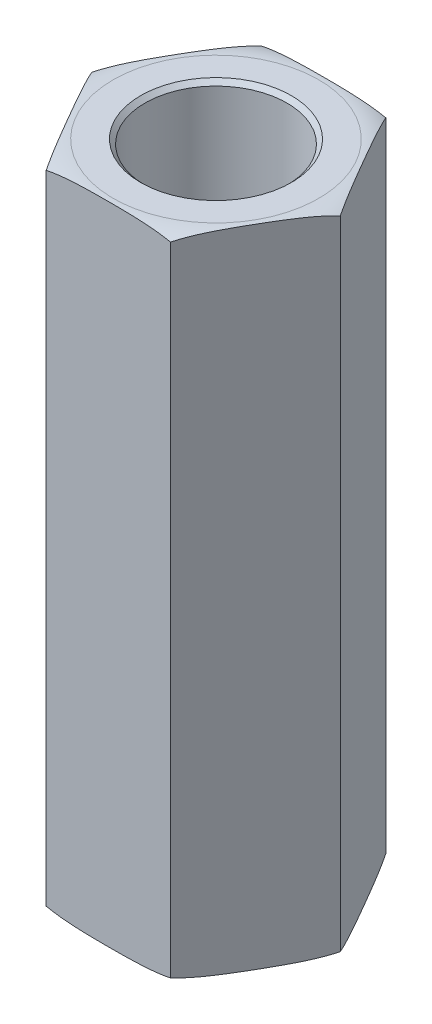
ISO-10303-21;
HEADER;
FILE_DESCRIPTION(('STEP AP214'),'2;1');
FILE_NAME('part.step','',(''),(''),'','','');
FILE_SCHEMA(('AUTOMOTIVE_DESIGN { 1 0 10303 214 1 1 1 1 }'));
ENDSEC;
DATA;
#1=APPLICATION_CONTEXT('core data for automotive mechanical design processes');
#2=APPLICATION_PROTOCOL_DEFINITION('international standard','automotive_design',2000,#1);
#3=PRODUCT_CONTEXT('',#1,'mechanical');
#4=PRODUCT('Part','Part','',(#3));
#5=PRODUCT_RELATED_PRODUCT_CATEGORY('part','',(#4));
#6=PRODUCT_DEFINITION_FORMATION('','',#4);
#7=PRODUCT_DEFINITION_CONTEXT('part definition',#1,'design');
#8=PRODUCT_DEFINITION('design','',#6,#7);
#9=PRODUCT_DEFINITION_SHAPE('','',#8);
#10=(LENGTH_UNIT() NAMED_UNIT(*) SI_UNIT(.MILLI.,.METRE.));
#11=(NAMED_UNIT(*) PLANE_ANGLE_UNIT() SI_UNIT($,.RADIAN.));
#12=(NAMED_UNIT(*) SI_UNIT($,.STERADIAN.) SOLID_ANGLE_UNIT());
#13=UNCERTAINTY_MEASURE_WITH_UNIT(LENGTH_MEASURE(1.E-05),#10,'distance_accuracy_value','');
#14=(GEOMETRIC_REPRESENTATION_CONTEXT(3) GLOBAL_UNCERTAINTY_ASSIGNED_CONTEXT((#13)) GLOBAL_UNIT_ASSIGNED_CONTEXT((#10,
#11,#12)) REPRESENTATION_CONTEXT('',''));
#15=CARTESIAN_POINT('',(0.,0.,0.));
#16=DIRECTION('',(0.,0.,1.));
#17=DIRECTION('',(1.,0.,0.));
#18=AXIS2_PLACEMENT_3D('',#15,#16,#17);
#19=CARTESIAN_POINT('',(3.66617420935412,9.525,0.));
#20=DIRECTION('',(-0.866025403784439,0.,0.5));
#21=DIRECTION('',(0.5,0.,0.866025403784439));
#22=AXIS2_PLACEMENT_3D('',#19,#20,#21);
#23=PLANE('',#22);
#24=CARTESIAN_POINT('',(3.66617420935412,9.398,0.));
#25=CARTESIAN_POINT('',(3.63753042799203,9.40993202468709,-0.0496124846400275));
#26=CARTESIAN_POINT('',(3.60875945805376,9.42055614694223,-0.0994452663561576));
#27=CARTESIAN_POINT('',(3.5510445941875,9.43952869380446,-0.199410342924434));
#28=CARTESIAN_POINT('',(3.52210079717004,9.44787829008084,-0.249542469922636));
#29=CARTESIAN_POINT('',(3.43520914920621,9.47001015084215,-0.400043218949384));
#30=CARTESIAN_POINT('',(3.37708055050429,9.48092253839952,-0.500724905273881));
#31=CARTESIAN_POINT('',(3.26070078255249,9.4975474670846,-0.702300576339476));
#32=CARTESIAN_POINT('',(3.20244972255356,9.50326351393611,-0.803194371852361));
#33=CARTESIAN_POINT('',(3.08586365366197,9.51154325238667,-1.00512736662733));
#34=CARTESIAN_POINT('',(3.02752861562773,9.5141051045623,-1.1061666163641));
#35=CARTESIAN_POINT('',(2.91138213832281,9.5174800878033,-1.30733821617637));
#36=CARTESIAN_POINT('',(2.85357078573453,9.51830898530758,-1.40747041611355));
#37=CARTESIAN_POINT('',(2.73795502274299,9.51890235146376,-1.60772279177072));
#38=CARTESIAN_POINT('',(2.68015061252642,9.51866697200316,-1.70784296716739));
#39=CARTESIAN_POINT('',(2.56452713843041,9.51693398748164,-1.9081086988493));
#40=CARTESIAN_POINT('',(2.50670807591217,9.51543597123025,-2.00825425277689));
#41=CARTESIAN_POINT('',(2.39109525560102,9.51017531674577,-2.20850153156214));
#42=CARTESIAN_POINT('',(2.33330149587798,9.50641290136093,-2.30860325976287));
#43=CARTESIAN_POINT('',(2.23849359853911,9.49698899303816,-2.47281535491256));
#44=CARTESIAN_POINT('',(2.20145192539195,9.49249057663768,-2.5369734148008));
#45=CARTESIAN_POINT('',(2.12747060706785,9.48130148199487,-2.66511281694908));
#46=CARTESIAN_POINT('',(2.09053091530161,9.47461207209161,-2.72909423990413));
#47=CARTESIAN_POINT('',(2.01669860633929,9.45839780386584,-2.85697555026699));
#48=CARTESIAN_POINT('',(1.97980639337021,9.44886525006224,-2.92087473753309));
#49=CARTESIAN_POINT('',(1.90623831426152,9.42626291445617,-3.04829838836459));
#50=CARTESIAN_POINT('',(1.86956287153406,9.41318767878213,-3.11182211855863));
#51=CARTESIAN_POINT('',(1.83308710467706,9.398,-3.175));
#52=B_SPLINE_CURVE_WITH_KNOTS('',3,(#24,#25,#26,#27,#28,#29,#30,#31,#32,#33,#34,#35,#36,#37,#38,
#39,#40,#41,#42,#43,#44,#45,#46,#47,#48,#49,#50,#51),.UNSPECIFIED.,.F.,.F.,(4,2,2,2,2,2,2,2,2,2,
2,2,2,4),(0.,0.17550946738822,0.350928353443244,0.701031261588482,1.05089779629354,
1.40096826525493,1.74783967758031,2.09466158796881,2.44159648808703,2.78849725058543,
3.0111319819994,3.23363806003511,3.45675194236245,3.68021127402553),.UNSPECIFIED.);
#53=CARTESIAN_POINT('',(3.66617420935412,9.398,0.));
#54=VERTEX_POINT('',#53);
#55=CARTESIAN_POINT('',(1.83308710467706,9.398,-3.175));
#56=VERTEX_POINT('',#55);
#57=EDGE_CURVE('E108',#54,#56,#52,.T.);
#58=ORIENTED_EDGE('',*,*,#57,.F.);
#59=DIRECTION('',(0.,1.,0.));
#60=VECTOR('',#59,1.);
#61=CARTESIAN_POINT('',(3.66617420935412,9.525,0.));
#62=LINE('',#61,#60);
#63=CARTESIAN_POINT('',(3.66617420935412,-9.398,0.));
#64=VERTEX_POINT('',#63);
#65=EDGE_CURVE('E81',#54,#64,#62,.F.);
#66=ORIENTED_EDGE('',*,*,#65,.T.);
#67=CARTESIAN_POINT('',(1.83308710467705,-9.398,-3.17500000000001));
#68=CARTESIAN_POINT('',(1.86173088603914,-9.40993202468709,-3.12538751535998));
#69=CARTESIAN_POINT('',(1.89050185597741,-9.42055614694223,-3.07555473364385));
#70=CARTESIAN_POINT('',(1.94821671984367,-9.43952869380445,-2.97558965707558));
#71=CARTESIAN_POINT('',(1.97716051686113,-9.44787829008084,-2.92545753007738));
#72=CARTESIAN_POINT('',(2.06405216482496,-9.47001015084215,-2.77495678105063));
#73=CARTESIAN_POINT('',(2.12218076352687,-9.48092253839952,-2.67427509472614));
#74=CARTESIAN_POINT('',(2.23856053147867,-9.4975474670846,-2.47269942366054));
#75=CARTESIAN_POINT('',(2.2968115914776,-9.50326351393611,-2.37180562814766));
#76=CARTESIAN_POINT('',(2.41339766036919,-9.51154325238667,-2.1698726333727));
#77=CARTESIAN_POINT('',(2.47173269840343,-9.5141051045623,-2.06883338363593));
#78=CARTESIAN_POINT('',(2.58787917570835,-9.5174800878033,-1.86766178382366));
#79=CARTESIAN_POINT('',(2.64569052829663,-9.51830898530758,-1.76752958388648));
#80=CARTESIAN_POINT('',(2.76130629128816,-9.51890235146376,-1.56727720822931));
#81=CARTESIAN_POINT('',(2.81911070150473,-9.51866697200316,-1.46715703283265));
#82=CARTESIAN_POINT('',(2.93473417560074,-9.51693398748165,-1.26689130115074));
#83=CARTESIAN_POINT('',(2.99255323811898,-9.51543597123026,-1.16674574722316));
#84=CARTESIAN_POINT('',(3.10816605843013,-9.51017531674577,-0.966498468437907));
#85=CARTESIAN_POINT('',(3.16595981815317,-9.50641290136093,-0.866396740237176));
#86=CARTESIAN_POINT('',(3.26076771549203,-9.49698899303816,-0.702184645087488));
#87=CARTESIAN_POINT('',(3.2978093886392,-9.49249057663768,-0.63802658519924));
#88=CARTESIAN_POINT('',(3.37179070696331,-9.48130148199488,-0.509887183050958));
#89=CARTESIAN_POINT('',(3.40873039872954,-9.47461207209161,-0.445905760095904));
#90=CARTESIAN_POINT('',(3.48256270769187,-9.45839780386584,-0.318024449733033));
#91=CARTESIAN_POINT('',(3.51945492066095,-9.44886525006225,-0.254125262466928));
#92=CARTESIAN_POINT('',(3.59302299976965,-9.42626291445618,-0.126701611635421));
#93=CARTESIAN_POINT('',(3.62969844249711,-9.41318767878214,-0.0631778814413773));
#94=CARTESIAN_POINT('',(3.66617420935412,-9.398,0.));
#95=B_SPLINE_CURVE_WITH_KNOTS('',3,(#67,#68,#69,#70,#71,#72,#73,#74,#75,#76,#77,#78,#79,#80,#81,
#82,#83,#84,#85,#86,#87,#88,#89,#90,#91,#92,#93,#94),.UNSPECIFIED.,.F.,.F.,(4,2,2,2,2,2,2,2,2,2,
2,2,2,4),(0.,0.175509467388216,0.350928353443236,0.701031261588468,1.05089779629352,
1.4009682652549,1.74783967758028,2.09466158796877,2.44159648808698,2.78849725058538,
3.01113198199936,3.23363806003509,3.45675194236244,3.68021127402553),.UNSPECIFIED.);
#96=CARTESIAN_POINT('',(1.83308710467705,-9.398,-3.175));
#97=VERTEX_POINT('',#96);
#98=EDGE_CURVE('E98',#97,#64,#95,.T.);
#99=ORIENTED_EDGE('',*,*,#98,.F.);
#100=DIRECTION('',(0.,1.,0.));
#101=VECTOR('',#100,1.);
#102=CARTESIAN_POINT('',(1.83308710467705,9.525,-3.175));
#103=LINE('',#102,#101);
#104=EDGE_CURVE('E112',#97,#56,#103,.T.);
#105=ORIENTED_EDGE('',*,*,#104,.T.);
#106=EDGE_LOOP('',(#58,#66,#99,#105));
#107=FACE_BOUND('',#106,.T.);
#108=ADVANCED_FACE('F17',(#107),#23,.F.);
#109=CARTESIAN_POINT('',(1.83308710467706,9.525,3.17499999999999));
#110=DIRECTION('',(-0.866025403784439,0.,-0.5));
#111=DIRECTION('',(-0.5,0.,0.866025403784439));
#112=AXIS2_PLACEMENT_3D('',#109,#110,#111);
#113=PLANE('',#112);
#114=CARTESIAN_POINT('',(1.83308710467706,9.398,3.17499999999999));
#115=CARTESIAN_POINT('',(1.86173088603915,9.40993202468709,3.12538751535996));
#116=CARTESIAN_POINT('',(1.89050185597743,9.42055614694223,3.07555473364383));
#117=CARTESIAN_POINT('',(1.94821671984368,9.43952869380446,2.97558965707556));
#118=CARTESIAN_POINT('',(1.97716051686114,9.44787829008084,2.92545753007735));
#119=CARTESIAN_POINT('',(2.06405216482498,9.47001015084215,2.77495678105061));
#120=CARTESIAN_POINT('',(2.12218076352689,9.48092253839952,2.67427509472611));
#121=CARTESIAN_POINT('',(2.23856053147869,9.4975474670846,2.47269942366051));
#122=CARTESIAN_POINT('',(2.29681159147762,9.50326351393611,2.37180562814763));
#123=CARTESIAN_POINT('',(2.41339766036921,9.51154325238667,2.16987263337266));
#124=CARTESIAN_POINT('',(2.47173269840345,9.5141051045623,2.06883338363589));
#125=CARTESIAN_POINT('',(2.58787917570837,9.5174800878033,1.86766178382362));
#126=CARTESIAN_POINT('',(2.64569052829666,9.51830898530758,1.76752958388644));
#127=CARTESIAN_POINT('',(2.76130629128819,9.51890235146376,1.56727720822927));
#128=CARTESIAN_POINT('',(2.81911070150476,9.51866697200316,1.4671570328326));
#129=CARTESIAN_POINT('',(2.93473417560078,9.51693398748164,1.26689130115069));
#130=CARTESIAN_POINT('',(2.99255323811901,9.51543597123025,1.1667457472231));
#131=CARTESIAN_POINT('',(3.10816605843017,9.51017531674577,0.966498468437848));
#132=CARTESIAN_POINT('',(3.16595981815321,9.50641290136093,0.866396740237115));
#133=CARTESIAN_POINT('',(3.26076771549207,9.49698899303816,0.702184645087431));
#134=CARTESIAN_POINT('',(3.29780938863923,9.49249057663768,0.638026585199189));
#135=CARTESIAN_POINT('',(3.37179070696333,9.48130148199487,0.509887183050919));
#136=CARTESIAN_POINT('',(3.40873039872956,9.47461207209161,0.44590576009587));
#137=CARTESIAN_POINT('',(3.48256270769188,9.45839780386584,0.31802444973301));
#138=CARTESIAN_POINT('',(3.51945492066096,9.44886525006224,0.254125262466912));
#139=CARTESIAN_POINT('',(3.59302299976965,9.42626291445617,0.126701611635416));
#140=CARTESIAN_POINT('',(3.62969844249711,9.41318767878213,0.0631778814413771));
#141=CARTESIAN_POINT('',(3.66617420935412,9.398,0.));
#142=B_SPLINE_CURVE_WITH_KNOTS('',3,(#114,#115,#116,#117,#118,#119,#120,#121,#122,#123,#124,
#125,#126,#127,#128,#129,#130,#131,#132,#133,#134,#135,#136,#137,#138,#139,#140,#141),
.UNSPECIFIED.,.F.,.F.,(4,2,2,2,2,2,2,2,2,2,2,2,2,4),(0.,0.17550946738822,0.350928353443244,
0.701031261588483,1.05089779629354,1.40096826525493,1.74783967758031,2.09466158796881,
2.44159648808703,2.78849725058544,3.01113198199939,3.2336380600351,3.45675194236244,
3.68021127402551),.UNSPECIFIED.);
#143=CARTESIAN_POINT('',(1.83308710467707,9.398,3.17499999999999));
#144=VERTEX_POINT('',#143);
#145=EDGE_CURVE('E22',#144,#54,#142,.T.);
#146=ORIENTED_EDGE('',*,*,#145,.F.);
#147=DIRECTION('',(0.,1.,0.));
#148=VECTOR('',#147,1.);
#149=CARTESIAN_POINT('',(1.83308710467707,9.525,3.17499999999999));
#150=LINE('',#149,#148);
#151=CARTESIAN_POINT('',(1.83308710467706,-9.398,3.17499999999999));
#152=VERTEX_POINT('',#151);
#153=EDGE_CURVE('E101',#144,#152,#150,.F.);
#154=ORIENTED_EDGE('',*,*,#153,.T.);
#155=CARTESIAN_POINT('',(3.66617420935412,-9.398,0.));
#156=CARTESIAN_POINT('',(3.63753042799203,-9.40993202468709,0.0496124846400324));
#157=CARTESIAN_POINT('',(3.60875945805375,-9.42055614694223,0.0994452663561624));
#158=CARTESIAN_POINT('',(3.5510445941875,-9.43952869380445,0.199410342924438));
#159=CARTESIAN_POINT('',(3.52210079717004,-9.44787829008084,0.24954246992264));
#160=CARTESIAN_POINT('',(3.43520914920621,-9.47001015084215,0.400043218949389));
#161=CARTESIAN_POINT('',(3.37708055050429,-9.48092253839952,0.500724905273886));
#162=CARTESIAN_POINT('',(3.26070078255249,-9.4975474670846,0.702300576339482));
#163=CARTESIAN_POINT('',(3.20244972255356,-9.50326351393611,0.803194371852367));
#164=CARTESIAN_POINT('',(3.08586365366197,-9.51154325238667,1.00512736662734));
#165=CARTESIAN_POINT('',(3.02752861562773,-9.5141051045623,1.1061666163641));
#166=CARTESIAN_POINT('',(2.91138213832281,-9.5174800878033,1.30733821617637));
#167=CARTESIAN_POINT('',(2.85357078573452,-9.51830898530758,1.40747041611356));
#168=CARTESIAN_POINT('',(2.73795502274299,-9.51890235146376,1.60772279177073));
#169=CARTESIAN_POINT('',(2.68015061252642,-9.51866697200316,1.70784296716739));
#170=CARTESIAN_POINT('',(2.5645271384304,-9.51693398748164,1.90810869884931));
#171=CARTESIAN_POINT('',(2.50670807591217,-9.51543597123025,2.00825425277689));
#172=CARTESIAN_POINT('',(2.39109525560101,-9.51017531674577,2.20850153156215));
#173=CARTESIAN_POINT('',(2.33330149587797,-9.50641290136093,2.30860325976288));
#174=CARTESIAN_POINT('',(2.23849359853911,-9.49698899303816,2.47281535491257));
#175=CARTESIAN_POINT('',(2.20145192539195,-9.49249057663768,2.53697341480081));
#176=CARTESIAN_POINT('',(2.12747060706785,-9.48130148199487,2.66511281694908));
#177=CARTESIAN_POINT('',(2.09053091530162,-9.47461207209161,2.72909423990413));
#178=CARTESIAN_POINT('',(2.0166986063393,-9.45839780386584,2.85697555026699));
#179=CARTESIAN_POINT('',(1.97980639337022,-9.44886525006225,2.92087473753308));
#180=CARTESIAN_POINT('',(1.90623831426153,-9.42626291445618,3.04829838836458));
#181=CARTESIAN_POINT('',(1.86956287153407,-9.41318767878214,3.11182211855862));
#182=CARTESIAN_POINT('',(1.83308710467706,-9.398,3.17499999999999));
#183=B_SPLINE_CURVE_WITH_KNOTS('',3,(#155,#156,#157,#158,#159,#160,#161,#162,#163,#164,#165,
#166,#167,#168,#169,#170,#171,#172,#173,#174,#175,#176,#177,#178,#179,#180,#181,#182),
.UNSPECIFIED.,.F.,.F.,(4,2,2,2,2,2,2,2,2,2,2,2,2,4),(0.,0.175509467388219,0.350928353443244,
0.701031261588483,1.05089779629354,1.40096826525493,1.74783967758031,2.09466158796881,
2.44159648808703,2.78849725058544,3.01113198199939,3.2336380600351,3.45675194236244,
3.68021127402551),.UNSPECIFIED.);
#184=EDGE_CURVE('E215',#64,#152,#183,.T.);
#185=ORIENTED_EDGE('',*,*,#184,.F.);
#186=ORIENTED_EDGE('',*,*,#65,.F.);
#187=EDGE_LOOP('',(#146,#154,#185,#186));
#188=FACE_BOUND('',#187,.T.);
#189=ADVANCED_FACE('F107',(#188),#113,.F.);
#190=CARTESIAN_POINT('',(-1.83308710467707,9.525,3.175));
#191=DIRECTION('',(0.,0.,-1.));
#192=DIRECTION('',(-1.,0.,0.));
#193=AXIS2_PLACEMENT_3D('',#190,#191,#192);
#194=PLANE('',#193);
#195=ORIENTED_EDGE('',*,*,#153,.F.);
#196=CARTESIAN_POINT('',(-1.83308710467707,9.39799999999999,3.175));
#197=CARTESIAN_POINT('',(-1.75760871054776,9.41371230122365,3.175));
#198=CARTESIAN_POINT('',(-1.68170571468658,9.4271647800808,3.175));
#199=CARTESIAN_POINT('',(-1.52939807527773,9.45030486470105,3.175));
#200=CARTESIAN_POINT('',(-1.45299400110163,9.45999617502722,3.175));
#201=CARTESIAN_POINT('',(-1.30011823209763,9.47637135267139,3.175));
#202=CARTESIAN_POINT('',(-1.22364747610196,9.48306442247852,3.175));
#203=CARTESIAN_POINT('',(-1.07052459410173,9.49417241699752,3.175));
#204=CARTESIAN_POINT('',(-0.993872424115956,9.49858671655426,3.175));
#205=CARTESIAN_POINT('',(-0.840856910195845,9.50572419802799,3.175));
#206=CARTESIAN_POINT('',(-0.764493913329281,9.50845527367792,3.175));
#207=CARTESIAN_POINT('',(-0.611734616938516,9.51275632258004,3.175));
#208=CARTESIAN_POINT('',(-0.535338316331409,9.51432625473884,3.175));
#209=CARTESIAN_POINT('',(-0.38245423122642,9.51668247076568,3.175));
#210=CARTESIAN_POINT('',(-0.305966435115039,9.51746792759645,3.175));
#211=CARTESIAN_POINT('',(-0.152985759387012,9.51848841069005,3.175));
#212=CARTESIAN_POINT('',(-0.076492879693506,9.51872342414921,3.175));
#213=CARTESIAN_POINT('',(0.0764928796935065,9.51872342414921,3.175));
#214=CARTESIAN_POINT('',(0.152985759387013,9.51848841069005,3.17499999999999));
#215=CARTESIAN_POINT('',(0.305966435115039,9.51746792759645,3.17499999999999));
#216=CARTESIAN_POINT('',(0.38245423122642,9.51668247076568,3.17499999999999));
#217=CARTESIAN_POINT('',(0.535338316331409,9.51432625473884,3.17499999999999));
#218=CARTESIAN_POINT('',(0.611734616938516,9.51275632258004,3.17499999999999));
#219=CARTESIAN_POINT('',(0.764493913329281,9.50845527367792,3.17499999999999));
#220=CARTESIAN_POINT('',(0.840856910195845,9.50572419802799,3.17499999999999));
#221=CARTESIAN_POINT('',(0.993872424115955,9.49858671655426,3.17499999999999));
#222=CARTESIAN_POINT('',(1.07052459410172,9.49417241699752,3.17499999999999));
#223=CARTESIAN_POINT('',(1.22364747610196,9.48306442247852,3.17499999999999));
#224=CARTESIAN_POINT('',(1.30011823209763,9.47637135267139,3.17499999999999));
#225=CARTESIAN_POINT('',(1.45299400110163,9.45999617502723,3.17499999999999));
#226=CARTESIAN_POINT('',(1.52939807527773,9.45030486470105,3.17499999999999));
#227=CARTESIAN_POINT('',(1.68170571468658,9.42716478008081,3.17499999999999));
#228=CARTESIAN_POINT('',(1.75760871054776,9.41371230122365,3.17499999999999));
#229=CARTESIAN_POINT('',(1.83308710467707,9.398,3.17499999999999));
#230=B_SPLINE_CURVE_WITH_KNOTS('',3,(#196,#197,#198,#199,#200,#201,#202,#203,#204,#205,#206,
#207,#208,#209,#210,#211,#212,#213,#214,#215,#216,#217,#218,#219,#220,#221,#222,#223,#224,#225,
#226,#227,#228,#229),.UNSPECIFIED.,.F.,.F.,(4,2,2,2,2,2,2,2,2,2,2,2,2,2,2,2,4),(0.,
0.23119079437731,0.46215329593589,0.692401964780504,0.922713766248053,1.15193709952408,
1.3811685447265,1.61064140410055,1.84011960111017,2.06959779811978,2.29907065749383,
2.52830210269626,2.75752543597228,2.98783723743982,3.21808590628444,3.44904840784302,
3.68023920222033),.UNSPECIFIED.);
#231=CARTESIAN_POINT('',(-1.83308710467707,9.398,3.175));
#232=VERTEX_POINT('',#231);
#233=EDGE_CURVE('E87',#232,#144,#230,.T.);
#234=ORIENTED_EDGE('',*,*,#233,.F.);
#235=DIRECTION('',(0.,1.,0.));
#236=VECTOR('',#235,1.);
#237=CARTESIAN_POINT('',(-1.83308710467707,9.525,3.175));
#238=LINE('',#237,#236);
#239=CARTESIAN_POINT('',(-1.83308710467707,-9.398,3.175));
#240=VERTEX_POINT('',#239);
#241=EDGE_CURVE('E105',#232,#240,#238,.F.);
#242=ORIENTED_EDGE('',*,*,#241,.T.);
#243=CARTESIAN_POINT('',(1.83308710467706,-9.398,3.17499999999999));
#244=CARTESIAN_POINT('',(1.75760871054776,-9.41371230122365,3.17499999999999));
#245=CARTESIAN_POINT('',(1.68170571468658,-9.42716478008081,3.17499999999999));
#246=CARTESIAN_POINT('',(1.52939807527773,-9.45030486470105,3.17499999999999));
#247=CARTESIAN_POINT('',(1.45299400110163,-9.45999617502723,3.17499999999999));
#248=CARTESIAN_POINT('',(1.30011823209763,-9.47637135267139,3.17499999999999));
#249=CARTESIAN_POINT('',(1.22364747610196,-9.48306442247852,3.17499999999999));
#250=CARTESIAN_POINT('',(1.07052459410172,-9.49417241699752,3.17499999999999));
#251=CARTESIAN_POINT('',(0.993872424115954,-9.49858671655426,3.17499999999999));
#252=CARTESIAN_POINT('',(0.840856910195844,-9.50572419802799,3.17499999999999));
#253=CARTESIAN_POINT('',(0.76449391332928,-9.50845527367792,3.17499999999999));
#254=CARTESIAN_POINT('',(0.611734616938514,-9.51275632258004,3.17499999999999));
#255=CARTESIAN_POINT('',(0.535338316331408,-9.51432625473884,3.17499999999999));
#256=CARTESIAN_POINT('',(0.382454231226419,-9.51668247076568,3.17499999999999));
#257=CARTESIAN_POINT('',(0.305966435115038,-9.51746792759645,3.17499999999999));
#258=CARTESIAN_POINT('',(0.152985759387012,-9.51848841069005,3.17499999999999));
#259=CARTESIAN_POINT('',(0.076492879693506,-9.51872342414921,3.175));
#260=CARTESIAN_POINT('',(-0.0764928796935062,-9.51872342414921,3.175));
#261=CARTESIAN_POINT('',(-0.152985759387012,-9.51848841069005,3.175));
#262=CARTESIAN_POINT('',(-0.305966435115038,-9.51746792759645,3.175));
#263=CARTESIAN_POINT('',(-0.382454231226419,-9.51668247076568,3.175));
#264=CARTESIAN_POINT('',(-0.535338316331408,-9.51432625473884,3.175));
#265=CARTESIAN_POINT('',(-0.611734616938515,-9.51275632258004,3.175));
#266=CARTESIAN_POINT('',(-0.76449391332928,-9.50845527367792,3.175));
#267=CARTESIAN_POINT('',(-0.840856910195844,-9.50572419802799,3.175));
#268=CARTESIAN_POINT('',(-0.993872424115954,-9.49858671655426,3.175));
#269=CARTESIAN_POINT('',(-1.07052459410172,-9.49417241699752,3.175));
#270=CARTESIAN_POINT('',(-1.22364747610196,-9.48306442247852,3.175));
#271=CARTESIAN_POINT('',(-1.30011823209763,-9.47637135267139,3.175));
#272=CARTESIAN_POINT('',(-1.45299400110163,-9.45999617502722,3.175));
#273=CARTESIAN_POINT('',(-1.52939807527773,-9.45030486470105,3.175));
#274=CARTESIAN_POINT('',(-1.68170571468658,-9.4271647800808,3.175));
#275=CARTESIAN_POINT('',(-1.75760871054776,-9.41371230122365,3.175));
#276=CARTESIAN_POINT('',(-1.83308710467706,-9.398,3.175));
#277=B_SPLINE_CURVE_WITH_KNOTS('',3,(#243,#244,#245,#246,#247,#248,#249,#250,#251,#252,#253,
#254,#255,#256,#257,#258,#259,#260,#261,#262,#263,#264,#265,#266,#267,#268,#269,#270,#271,#272,
#273,#274,#275,#276),.UNSPECIFIED.,.F.,.F.,(4,2,2,2,2,2,2,2,2,2,2,2,2,2,2,2,4),(0.,
0.23119079437731,0.462153295935889,0.692401964780503,0.922713766248051,1.15193709952407,
1.3811685447265,1.61064140410055,1.84011960111016,2.06959779811977,2.29907065749383,
2.52830210269625,2.75752543597227,2.98783723743982,3.21808590628443,3.44904840784301,
3.68023920222032),.UNSPECIFIED.);
#278=EDGE_CURVE('E103',#152,#240,#277,.T.);
#279=ORIENTED_EDGE('',*,*,#278,.F.);
#280=EDGE_LOOP('',(#195,#234,#242,#279));
#281=FACE_BOUND('',#280,.T.);
#282=ADVANCED_FACE('F102',(#281),#194,.F.);
#283=CARTESIAN_POINT('',(-3.66617420935413,9.525,0.));
#284=DIRECTION('',(0.866025403784439,0.,-0.499999999999999));
#285=DIRECTION('',(-0.499999999999999,0.,-0.866025403784439));
#286=AXIS2_PLACEMENT_3D('',#283,#284,#285);
#287=PLANE('',#286);
#288=CARTESIAN_POINT('',(-3.66617420935412,9.39799999999999,0.));
#289=CARTESIAN_POINT('',(-3.63753042799204,9.40993202468708,0.0496124846400222));
#290=CARTESIAN_POINT('',(-3.60875945805377,9.42055614694222,0.0994452663561455));
#291=CARTESIAN_POINT('',(-3.55104459418752,9.43952869380445,0.199410342924408));
#292=CARTESIAN_POINT('',(-3.52210079717006,9.44787829008083,0.249542469922603));
#293=CARTESIAN_POINT('',(-3.43520914920624,9.47001015084215,0.400043218949332));
#294=CARTESIAN_POINT('',(-3.37708055050434,9.48092253839951,0.500724905273816));
#295=CARTESIAN_POINT('',(-3.26070078255255,9.4975474670846,0.702300576339384));
#296=CARTESIAN_POINT('',(-3.20244972255363,9.50326351393611,0.803194371852256));
#297=CARTESIAN_POINT('',(-3.08586365366205,9.51154325238667,1.0051273666272));
#298=CARTESIAN_POINT('',(-3.02752861562782,9.5141051045623,1.10616661636395));
#299=CARTESIAN_POINT('',(-2.91138213832292,9.5174800878033,1.30733821617619));
#300=CARTESIAN_POINT('',(-2.85357078573464,9.51830898530758,1.40747041611336));
#301=CARTESIAN_POINT('',(-2.73795502274313,9.51890235146376,1.60772279177051));
#302=CARTESIAN_POINT('',(-2.68015061252656,9.51866697200317,1.70784296716716));
#303=CARTESIAN_POINT('',(-2.56452713843056,9.51693398748165,1.90810869884905));
#304=CARTESIAN_POINT('',(-2.50670807591233,9.51543597123026,2.00825425277662));
#305=CARTESIAN_POINT('',(-2.39109525560119,9.51017531674578,2.20850153156185));
#306=CARTESIAN_POINT('',(-2.33330149587816,9.50641290136095,2.30860325976257));
#307=CARTESIAN_POINT('',(-2.23849359853929,9.49698899303818,2.47281535491227));
#308=CARTESIAN_POINT('',(-2.20145192539211,9.4924905766377,2.53697341480054));
#309=CARTESIAN_POINT('',(-2.12747060706798,9.48130148199489,2.66511281694887));
#310=CARTESIAN_POINT('',(-2.09053091530173,9.47461207209163,2.72909423990394));
#311=CARTESIAN_POINT('',(-2.01669860633938,9.45839780386585,2.85697555026686));
#312=CARTESIAN_POINT('',(-1.97980639337028,9.44886525006226,2.92087473753298));
#313=CARTESIAN_POINT('',(-1.90623831426156,9.42626291445618,3.04829838836453));
#314=CARTESIAN_POINT('',(-1.86956287153409,9.41318767878214,3.1118221185586));
#315=CARTESIAN_POINT('',(-1.83308710467707,9.39799999999999,3.175));
#316=B_SPLINE_CURVE_WITH_KNOTS('',3,(#288,#289,#290,#291,#292,#293,#294,#295,#296,#297,#298,
#299,#300,#301,#302,#303,#304,#305,#306,#307,#308,#309,#310,#311,#312,#313,#314,#315),
.UNSPECIFIED.,.F.,.F.,(4,2,2,2,2,2,2,2,2,2,2,2,2,4),(0.,0.175509467388196,0.350928353443197,
0.70103126158839,1.0508977962934,1.40096826525474,1.74783967758008,2.09466158796853,
2.4415964880867,2.78849725058507,3.01113198199912,3.23363806003492,3.45675194236235,
3.68021127402552),.UNSPECIFIED.);
#317=CARTESIAN_POINT('',(-3.66617420935413,9.39799999999999,0.));
#318=VERTEX_POINT('',#317);
#319=EDGE_CURVE('E95',#318,#232,#316,.T.);
#320=ORIENTED_EDGE('',*,*,#319,.F.);
#321=DIRECTION('',(0.,1.,0.));
#322=VECTOR('',#321,1.);
#323=CARTESIAN_POINT('',(-3.66617420935413,9.525,0.));
#324=LINE('',#323,#322);
#325=CARTESIAN_POINT('',(-3.66617420935413,-9.398,0.));
#326=VERTEX_POINT('',#325);
#327=EDGE_CURVE('E119',#318,#326,#324,.F.);
#328=ORIENTED_EDGE('',*,*,#327,.T.);
#329=CARTESIAN_POINT('',(-1.83308710467707,-9.39799999999999,3.175));
#330=CARTESIAN_POINT('',(-1.86173088603915,-9.40993202468708,3.12538751535998));
#331=CARTESIAN_POINT('',(-1.89050185597742,-9.42055614694222,3.07555473364385));
#332=CARTESIAN_POINT('',(-1.94821671984367,-9.43952869380445,2.97558965707558));
#333=CARTESIAN_POINT('',(-1.97716051686113,-9.44787829008083,2.92545753007739));
#334=CARTESIAN_POINT('',(-2.06405216482496,-9.47001015084215,2.77495678105065));
#335=CARTESIAN_POINT('',(-2.12218076352686,-9.48092253839952,2.67427509472617));
#336=CARTESIAN_POINT('',(-2.23856053147865,-9.4975474670846,2.47269942366059));
#337=CARTESIAN_POINT('',(-2.29681159147757,-9.50326351393611,2.37180562814772));
#338=CARTESIAN_POINT('',(-2.41339766036916,-9.51154325238667,2.16987263337277));
#339=CARTESIAN_POINT('',(-2.47173269840339,-9.5141051045623,2.06883338363601));
#340=CARTESIAN_POINT('',(-2.5878791757083,-9.5174800878033,1.86766178382376));
#341=CARTESIAN_POINT('',(-2.64569052829658,-9.51830898530758,1.76752958388659));
#342=CARTESIAN_POINT('',(-2.7613062912881,-9.51890235146376,1.56727720822944));
#343=CARTESIAN_POINT('',(-2.81911070150467,-9.51866697200316,1.46715703283278));
#344=CARTESIAN_POINT('',(-2.93473417560067,-9.51693398748165,1.26689130115088));
#345=CARTESIAN_POINT('',(-2.9925532381189,-9.51543597123026,1.16674574722331));
#346=CARTESIAN_POINT('',(-3.10816605843004,-9.51017531674578,0.966498468438076));
#347=CARTESIAN_POINT('',(-3.16595981815307,-9.50641290136094,0.866396740237353));
#348=CARTESIAN_POINT('',(-3.26076771549194,-9.49698899303818,0.702184645087658));
#349=CARTESIAN_POINT('',(-3.29780938863912,-9.49249057663769,0.638026585199395));
#350=CARTESIAN_POINT('',(-3.37179070696324,-9.48130148199489,0.509887183051082));
#351=CARTESIAN_POINT('',(-3.40873039872949,-9.47461207209162,0.445905760096013));
#352=CARTESIAN_POINT('',(-3.48256270769183,-9.45839780386585,0.318024449733112));
#353=CARTESIAN_POINT('',(-3.51945492066092,-9.44886525006225,0.254125262466993));
#354=CARTESIAN_POINT('',(-3.59302299976963,-9.42626291445618,0.126701611635455));
#355=CARTESIAN_POINT('',(-3.6296984424971,-9.41318767878214,0.0631778814413959));
#356=CARTESIAN_POINT('',(-3.66617420935412,-9.398,0.));
#357=B_SPLINE_CURVE_WITH_KNOTS('',3,(#329,#330,#331,#332,#333,#334,#335,#336,#337,#338,#339,
#340,#341,#342,#343,#344,#345,#346,#347,#348,#349,#350,#351,#352,#353,#354,#355,#356),
.UNSPECIFIED.,.F.,.F.,(4,2,2,2,2,2,2,2,2,2,2,2,2,4),(0.,0.175509467388203,0.350928353443209,
0.701031261588413,1.05089779629344,1.40096826525479,1.74783967758014,2.0946615879686,
2.44159648808678,2.78849725058516,3.01113198199919,3.23363806003497,3.45675194236238,
3.68021127402552),.UNSPECIFIED.);
#358=EDGE_CURVE('E204',#240,#326,#357,.T.);
#359=ORIENTED_EDGE('',*,*,#358,.F.);
#360=ORIENTED_EDGE('',*,*,#241,.F.);
#361=EDGE_LOOP('',(#320,#328,#359,#360));
#362=FACE_BOUND('',#361,.T.);
#363=ADVANCED_FACE('F198',(#362),#287,.F.);
#364=CARTESIAN_POINT('',(-1.83308710467707,9.525,-3.175));
#365=DIRECTION('',(0.866025403784439,0.,0.5));
#366=DIRECTION('',(0.5,0.,-0.866025403784439));
#367=AXIS2_PLACEMENT_3D('',#364,#365,#366);
#368=PLANE('',#367);
#369=CARTESIAN_POINT('',(-1.83308710467706,9.39799999999999,-3.17500000000001));
#370=CARTESIAN_POINT('',(-1.86173088603915,9.40993202468708,-3.12538751535999));
#371=CARTESIAN_POINT('',(-1.89050185597742,9.42055614694222,-3.07555473364386));
#372=CARTESIAN_POINT('',(-1.94821671984366,9.43952869380445,-2.9755896570756));
#373=CARTESIAN_POINT('',(-1.97716051686112,9.44787829008083,-2.92545753007741));
#374=CARTESIAN_POINT('',(-2.06405216482494,9.47001015084215,-2.77495678105068));
#375=CARTESIAN_POINT('',(-2.12218076352685,9.48092253839951,-2.6742750947262));
#376=CARTESIAN_POINT('',(-2.23856053147863,9.4975474670846,-2.47269942366064));
#377=CARTESIAN_POINT('',(-2.29681159147755,9.50326351393611,-2.37180562814777));
#378=CARTESIAN_POINT('',(-2.41339766036912,9.51154325238667,-2.16987263337283));
#379=CARTESIAN_POINT('',(-2.47173269840336,9.5141051045623,-2.06883338363608));
#380=CARTESIAN_POINT('',(-2.58787917570826,9.5174800878033,-1.86766178382384));
#381=CARTESIAN_POINT('',(-2.64569052829653,9.51830898530758,-1.76752958388667));
#382=CARTESIAN_POINT('',(-2.76130629128805,9.51890235146376,-1.56727720822953));
#383=CARTESIAN_POINT('',(-2.81911070150462,9.51866697200317,-1.46715703283288));
#384=CARTESIAN_POINT('',(-2.93473417560061,9.51693398748165,-1.26689130115099));
#385=CARTESIAN_POINT('',(-2.99255323811884,9.51543597123026,-1.16674574722342));
#386=CARTESIAN_POINT('',(-3.10816605842998,9.51017531674579,-0.966498468438198));
#387=CARTESIAN_POINT('',(-3.16595981815301,9.50641290136095,-0.86639674023748));
#388=CARTESIAN_POINT('',(-3.26076771549188,9.49698899303819,-0.702184645087778));
#389=CARTESIAN_POINT('',(-3.29780938863906,9.4924905766377,-0.638026585199504));
#390=CARTESIAN_POINT('',(-3.3717907069632,9.4813014819949,-0.50988718305117));
#391=CARTESIAN_POINT('',(-3.40873039872945,9.47461207209163,-0.44590576009609));
#392=CARTESIAN_POINT('',(-3.4825627076918,9.45839780386586,-0.318024449733166));
#393=CARTESIAN_POINT('',(-3.5194549206609,9.44886525006226,-0.254125262467035));
#394=CARTESIAN_POINT('',(-3.59302299976963,9.42626291445618,-0.126701611635476));
#395=CARTESIAN_POINT('',(-3.6296984424971,9.41318767878213,-0.0631778814414058));
#396=CARTESIAN_POINT('',(-3.66617420935413,9.39799999999999,0.));
#397=B_SPLINE_CURVE_WITH_KNOTS('',3,(#369,#370,#371,#372,#373,#374,#375,#376,#377,#378,#379,
#380,#381,#382,#383,#384,#385,#386,#387,#388,#389,#390,#391,#392,#393,#394,#395,#396),
.UNSPECIFIED.,.F.,.F.,(4,2,2,2,2,2,2,2,2,2,2,2,2,4),(0.,0.175509467388193,0.350928353443191,
0.701031261588377,1.05089779629338,1.40096826525472,1.74783967758005,2.0946615879685,
2.44159648808666,2.78849725058502,3.01113198199908,3.2336380600349,3.45675194236235,
3.68021127402553),.UNSPECIFIED.);
#398=CARTESIAN_POINT('',(-1.83308710467706,9.398,-3.175));
#399=VERTEX_POINT('',#398);
#400=EDGE_CURVE('E170',#399,#318,#397,.T.);
#401=ORIENTED_EDGE('',*,*,#400,.F.);
#402=DIRECTION('',(0.,1.,0.));
#403=VECTOR('',#402,1.);
#404=CARTESIAN_POINT('',(-1.83308710467706,9.525,-3.175));
#405=LINE('',#404,#403);
#406=CARTESIAN_POINT('',(-1.83308710467707,-9.39799999999999,-3.175));
#407=VERTEX_POINT('',#406);
#408=EDGE_CURVE('E109',#399,#407,#405,.F.);
#409=ORIENTED_EDGE('',*,*,#408,.T.);
#410=CARTESIAN_POINT('',(-3.66617420935413,-9.39799999999999,0.));
#411=CARTESIAN_POINT('',(-3.63753042799204,-9.40993202468708,-0.0496124846400259));
#412=CARTESIAN_POINT('',(-3.60875945805377,-9.42055614694222,-0.0994452663561509));
#413=CARTESIAN_POINT('',(-3.55104459418752,-9.43952869380445,-0.199410342924416));
#414=CARTESIAN_POINT('',(-3.52210079717006,-9.44787829008083,-0.249542469922613));
#415=CARTESIAN_POINT('',(-3.43520914920624,-9.47001015084215,-0.400043218949346));
#416=CARTESIAN_POINT('',(-3.37708055050433,-9.48092253839952,-0.500724905273833));
#417=CARTESIAN_POINT('',(-3.26070078255254,-9.4975474670846,-0.702300576339408));
#418=CARTESIAN_POINT('',(-3.20244972255362,-9.50326351393611,-0.803194371852283));
#419=CARTESIAN_POINT('',(-3.08586365366204,-9.51154325238667,-1.00512736662723));
#420=CARTESIAN_POINT('',(-3.0275286156278,-9.5141051045623,-1.10616661636399));
#421=CARTESIAN_POINT('',(-2.91138213832289,-9.5174800878033,-1.30733821617624));
#422=CARTESIAN_POINT('',(-2.85357078573462,-9.51830898530758,-1.40747041611341));
#423=CARTESIAN_POINT('',(-2.7379550227431,-9.51890235146376,-1.60772279177056));
#424=CARTESIAN_POINT('',(-2.68015061252653,-9.51866697200316,-1.70784296716722));
#425=CARTESIAN_POINT('',(-2.56452713843053,-9.51693398748165,-1.90810869884911));
#426=CARTESIAN_POINT('',(-2.5067080759123,-9.51543597123026,-2.00825425277669));
#427=CARTESIAN_POINT('',(-2.39109525560115,-9.51017531674578,-2.20850153156192));
#428=CARTESIAN_POINT('',(-2.33330149587812,-9.50641290136094,-2.30860325976265));
#429=CARTESIAN_POINT('',(-2.23849359853925,-9.49698899303818,-2.47281535491234));
#430=CARTESIAN_POINT('',(-2.20145192539208,-9.49249057663769,-2.53697341480061));
#431=CARTESIAN_POINT('',(-2.12747060706795,-9.48130148199489,-2.66511281694892));
#432=CARTESIAN_POINT('',(-2.09053091530171,-9.47461207209162,-2.72909423990399));
#433=CARTESIAN_POINT('',(-2.01669860633936,-9.45839780386585,-2.85697555026689));
#434=CARTESIAN_POINT('',(-1.97980639337027,-9.44886525006225,-2.92087473753301));
#435=CARTESIAN_POINT('',(-1.90623831426156,-9.42626291445618,-3.04829838836455));
#436=CARTESIAN_POINT('',(-1.86956287153409,-9.41318767878213,-3.11182211855861));
#437=CARTESIAN_POINT('',(-1.83308710467707,-9.39799999999999,-3.175));
#438=B_SPLINE_CURVE_WITH_KNOTS('',3,(#410,#411,#412,#413,#414,#415,#416,#417,#418,#419,#420,
#421,#422,#423,#424,#425,#426,#427,#428,#429,#430,#431,#432,#433,#434,#435,#436,#437),
.UNSPECIFIED.,.F.,.F.,(4,2,2,2,2,2,2,2,2,2,2,2,2,4),(0.,0.175509467388202,0.350928353443208,
0.701031261588412,1.05089779629344,1.40096826525479,1.74783967758014,2.0946615879686,
2.44159648808678,2.78849725058516,3.01113198199919,3.23363806003497,3.45675194236238,
3.68021127402553),.UNSPECIFIED.);
#439=EDGE_CURVE('E144',#326,#407,#438,.T.);
#440=ORIENTED_EDGE('',*,*,#439,.F.);
#441=ORIENTED_EDGE('',*,*,#327,.F.);
#442=EDGE_LOOP('',(#401,#409,#440,#441));
#443=FACE_BOUND('',#442,.T.);
#444=ADVANCED_FACE('F155',(#443),#368,.F.);
#445=CARTESIAN_POINT('',(1.83308710467706,9.525,-3.175));
#446=DIRECTION('',(0.,0.,1.));
#447=DIRECTION('',(1.,0.,0.));
#448=AXIS2_PLACEMENT_3D('',#445,#446,#447);
#449=PLANE('',#448);
#450=CARTESIAN_POINT('',(1.83308710467705,9.398,-3.175));
#451=CARTESIAN_POINT('',(1.75760871054775,9.41371230122365,-3.175));
#452=CARTESIAN_POINT('',(1.68170571468657,9.4271647800808,-3.175));
#453=CARTESIAN_POINT('',(1.52939807527772,9.45030486470105,-3.175));
#454=CARTESIAN_POINT('',(1.45299400110162,9.45999617502722,-3.175));
#455=CARTESIAN_POINT('',(1.30011823209763,9.47637135267139,-3.175));
#456=CARTESIAN_POINT('',(1.22364747610195,9.48306442247852,-3.175));
#457=CARTESIAN_POINT('',(1.07052459410172,9.49417241699752,-3.175));
#458=CARTESIAN_POINT('',(0.99387242411595,9.49858671655426,-3.175));
#459=CARTESIAN_POINT('',(0.84085691019584,9.50572419802799,-3.175));
#460=CARTESIAN_POINT('',(0.764493913329277,9.50845527367792,-3.175));
#461=CARTESIAN_POINT('',(0.611734616938512,9.51275632258004,-3.175));
#462=CARTESIAN_POINT('',(0.535338316331406,9.51432625473884,-3.175));
#463=CARTESIAN_POINT('',(0.382454231226418,9.51668247076568,-3.175));
#464=CARTESIAN_POINT('',(0.305966435115037,9.51746792759645,-3.175));
#465=CARTESIAN_POINT('',(0.152985759387012,9.51848841069005,-3.175));
#466=CARTESIAN_POINT('',(0.0764928796935062,9.51872342414921,-3.175));
#467=CARTESIAN_POINT('',(-0.0764928796935054,9.51872342414921,-3.175));
#468=CARTESIAN_POINT('',(-0.152985759387011,9.51848841069005,-3.175));
#469=CARTESIAN_POINT('',(-0.305966435115037,9.51746792759645,-3.175));
#470=CARTESIAN_POINT('',(-0.382454231226418,9.51668247076568,-3.175));
#471=CARTESIAN_POINT('',(-0.535338316331406,9.51432625473884,-3.175));
#472=CARTESIAN_POINT('',(-0.611734616938512,9.51275632258004,-3.175));
#473=CARTESIAN_POINT('',(-0.764493913329277,9.50845527367792,-3.175));
#474=CARTESIAN_POINT('',(-0.840856910195841,9.50572419802799,-3.175));
#475=CARTESIAN_POINT('',(-0.99387242411595,9.49858671655426,-3.175));
#476=CARTESIAN_POINT('',(-1.07052459410172,9.49417241699752,-3.175));
#477=CARTESIAN_POINT('',(-1.22364747610195,9.48306442247852,-3.175));
#478=CARTESIAN_POINT('',(-1.30011823209763,9.47637135267139,-3.175));
#479=CARTESIAN_POINT('',(-1.45299400110163,9.45999617502722,-3.175));
#480=CARTESIAN_POINT('',(-1.52939807527772,9.45030486470105,-3.175));
#481=CARTESIAN_POINT('',(-1.68170571468657,9.4271647800808,-3.175));
#482=CARTESIAN_POINT('',(-1.75760871054775,9.41371230122365,-3.175));
#483=CARTESIAN_POINT('',(-1.83308710467706,9.39799999999999,-3.175));
#484=B_SPLINE_CURVE_WITH_KNOTS('',3,(#450,#451,#452,#453,#454,#455,#456,#457,#458,#459,#460,
#461,#462,#463,#464,#465,#466,#467,#468,#469,#470,#471,#472,#473,#474,#475,#476,#477,#478,#479,
#480,#481,#482,#483),.UNSPECIFIED.,.F.,.F.,(4,2,2,2,2,2,2,2,2,2,2,2,2,2,2,2,4),(0.,
0.231190794377309,0.462153295935887,0.6924019647805,0.922713766248047,1.15193709952407,
1.38116854472649,1.61064140410054,1.84011960111015,2.06959779811976,2.29907065749382,
2.52830210269624,2.75752543597226,2.98783723743981,3.21808590628442,3.449048407843,
3.68023920222031),.UNSPECIFIED.);
#485=EDGE_CURVE('E110',#56,#399,#484,.T.);
#486=ORIENTED_EDGE('',*,*,#485,.F.);
#487=ORIENTED_EDGE('',*,*,#104,.F.);
#488=CARTESIAN_POINT('',(-1.83308710467707,-9.39799999999999,-3.175));
#489=CARTESIAN_POINT('',(-1.75760871054776,-9.41371230122365,-3.175));
#490=CARTESIAN_POINT('',(-1.68170571468658,-9.4271647800808,-3.175));
#491=CARTESIAN_POINT('',(-1.52939807527773,-9.45030486470105,-3.175));
#492=CARTESIAN_POINT('',(-1.45299400110163,-9.45999617502722,-3.175));
#493=CARTESIAN_POINT('',(-1.30011823209763,-9.47637135267139,-3.175));
#494=CARTESIAN_POINT('',(-1.22364747610196,-9.48306442247852,-3.175));
#495=CARTESIAN_POINT('',(-1.07052459410173,-9.49417241699752,-3.175));
#496=CARTESIAN_POINT('',(-0.993872424115956,-9.49858671655426,-3.175));
#497=CARTESIAN_POINT('',(-0.840856910195846,-9.50572419802799,-3.175));
#498=CARTESIAN_POINT('',(-0.764493913329282,-9.50845527367792,-3.175));
#499=CARTESIAN_POINT('',(-0.611734616938516,-9.51275632258004,-3.175));
#500=CARTESIAN_POINT('',(-0.535338316331409,-9.51432625473884,-3.175));
#501=CARTESIAN_POINT('',(-0.38245423122642,-9.51668247076568,-3.175));
#502=CARTESIAN_POINT('',(-0.305966435115039,-9.51746792759645,-3.175));
#503=CARTESIAN_POINT('',(-0.152985759387013,-9.51848841069005,-3.175));
#504=CARTESIAN_POINT('',(-0.0764928796935069,-9.51872342414921,-3.175));
#505=CARTESIAN_POINT('',(0.0764928796935047,-9.51872342414921,-3.175));
#506=CARTESIAN_POINT('',(0.15298575938701,-9.51848841069005,-3.175));
#507=CARTESIAN_POINT('',(0.305966435115035,-9.51746792759645,-3.175));
#508=CARTESIAN_POINT('',(0.382454231226415,-9.51668247076568,-3.175));
#509=CARTESIAN_POINT('',(0.535338316331403,-9.51432625473884,-3.175));
#510=CARTESIAN_POINT('',(0.611734616938509,-9.51275632258004,-3.175));
#511=CARTESIAN_POINT('',(0.764493913329273,-9.50845527367792,-3.175));
#512=CARTESIAN_POINT('',(0.840856910195836,-9.50572419802799,-3.175));
#513=CARTESIAN_POINT('',(0.993872424115945,-9.49858671655426,-3.175));
#514=CARTESIAN_POINT('',(1.07052459410171,-9.49417241699752,-3.175));
#515=CARTESIAN_POINT('',(1.22364747610195,-9.48306442247852,-3.175));
#516=CARTESIAN_POINT('',(1.30011823209762,-9.47637135267139,-3.175));
#517=CARTESIAN_POINT('',(1.45299400110162,-9.45999617502722,-3.175));
#518=CARTESIAN_POINT('',(1.52939807527771,-9.45030486470105,-3.175));
#519=CARTESIAN_POINT('',(1.68170571468656,-9.4271647800808,-3.175));
#520=CARTESIAN_POINT('',(1.75760871054774,-9.41371230122365,-3.175));
#521=CARTESIAN_POINT('',(1.83308710467705,-9.398,-3.175));
#522=B_SPLINE_CURVE_WITH_KNOTS('',3,(#488,#489,#490,#491,#492,#493,#494,#495,#496,#497,#498,
#499,#500,#501,#502,#503,#504,#505,#506,#507,#508,#509,#510,#511,#512,#513,#514,#515,#516,#517,
#518,#519,#520,#521),.UNSPECIFIED.,.F.,.F.,(4,2,2,2,2,2,2,2,2,2,2,2,2,2,2,2,4),(0.,
0.23119079437731,0.46215329593589,0.692401964780504,0.922713766248052,1.15193709952407,
1.3811685447265,1.61064140410055,1.84011960111016,2.06959779811977,2.29907065749382,
2.52830210269625,2.75752543597227,2.98783723743981,3.21808590628442,3.449048407843,
3.68023920222031),.UNSPECIFIED.);
#523=EDGE_CURVE('E137',#407,#97,#522,.T.);
#524=ORIENTED_EDGE('',*,*,#523,.F.);
#525=ORIENTED_EDGE('',*,*,#408,.F.);
#526=EDGE_LOOP('',(#486,#487,#524,#525));
#527=FACE_BOUND('',#526,.T.);
#528=ADVANCED_FACE('F151',(#527),#449,.F.);
#529=CARTESIAN_POINT('',(0.,7.87400000000011,0.));
#530=DIRECTION('',(0.,1.,0.));
#531=DIRECTION('',(-1.,0.,0.));
#532=AXIS2_PLACEMENT_3D('',#529,#530,#531);
#533=TOROIDAL_SURFACE('',#532,3.03117420935412,1.65099999999989);
#534=ORIENTED_EDGE('',*,*,#57,.T.);
#535=ORIENTED_EDGE('',*,*,#485,.T.);
#536=ORIENTED_EDGE('',*,*,#400,.T.);
#537=ORIENTED_EDGE('',*,*,#319,.T.);
#538=ORIENTED_EDGE('',*,*,#233,.T.);
#539=ORIENTED_EDGE('',*,*,#145,.T.);
#540=EDGE_LOOP('',(#534,#535,#536,#537,#538,#539));
#541=FACE_BOUND('',#540,.T.);
#542=CARTESIAN_POINT('',(0.,9.52500000000001,0.));
#543=DIRECTION('',(0.,1.,0.));
#544=DIRECTION('',(-1.,0.,0.));
#545=AXIS2_PLACEMENT_3D('',#542,#543,#544);
#546=CIRCLE('',#545,3.03117420935412);
#547=CARTESIAN_POINT('',(-3.03117420935412,9.52500000000001,0.));
#548=VERTEX_POINT('',#547);
#549=EDGE_CURVE('E134',#548,#548,#546,.F.);
#550=ORIENTED_EDGE('',*,*,#549,.T.);
#551=EDGE_LOOP('',(#550));
#552=FACE_BOUND('',#551,.T.);
#553=ADVANCED_FACE('F90',(#541,#552),#533,.T.);
#554=CARTESIAN_POINT('',(0.,-7.87400000000007,0.));
#555=DIRECTION('',(0.,-1.,0.));
#556=DIRECTION('',(1.,0.,0.));
#557=AXIS2_PLACEMENT_3D('',#554,#555,#556);
#558=TOROIDAL_SURFACE('',#557,3.03117420935412,1.65099999999993);
#559=CARTESIAN_POINT('',(0.,-9.525,-3.03117420935412));
#560=CARTESIAN_POINT('',(0.577948107970672,-9.525,-3.03107308501635));
#561=CARTESIAN_POINT('',(1.11575919022366,-9.525,-2.81835031833962));
#562=CARTESIAN_POINT('',(1.69861585330176,-9.525,-2.58781047630709));
#563=CARTESIAN_POINT('',(2.14336383839209,-9.525,-2.14336383839205));
#564=CARTESIAN_POINT('',(2.58666814314654,-9.525,-1.70035990262072));
#565=CARTESIAN_POINT('',(2.81835031833963,-9.525,-1.11575919022362));
#566=CARTESIAN_POINT('',(3.0309784255278,-9.525,-0.579237367453916));
#567=CARTESIAN_POINT('',(3.03117420935412,-9.525,0.));
#568=CARTESIAN_POINT('',(3.03136930427548,-9.525,0.577199203712815));
#569=CARTESIAN_POINT('',(2.81835031833961,-9.525,1.11575919022367));
#570=CARTESIAN_POINT('',(2.58781047292779,-9.525,1.69861585668335));
#571=CARTESIAN_POINT('',(2.14336383839205,-9.525,2.14336383839208));
#572=CARTESIAN_POINT('',(1.70035990262036,-9.525,2.58666814314691));
#573=CARTESIAN_POINT('',(1.11575919022363,-9.525,2.81835031833962));
#574=CARTESIAN_POINT('',(0.578998978320781,-9.525,3.03107290114443));
#575=CARTESIAN_POINT('',(0.,-9.525,3.03117420935412));
#576=B_SPLINE_CURVE_WITH_KNOTS('',2,(#559,#560,#561,#562,#563,#564,#565,#566,#567,#568,#569,
#570,#571,#572,#573,#574,#575),.UNSPECIFIED.,.F.,.F.,(3,2,2,2,2,2,2,2,3),(0.,0.125,0.25,0.375,
0.5,0.625,0.75,0.875,1.),.UNSPECIFIED.);
#577=CARTESIAN_POINT('',(0.,-9.525,-3.03117420935412));
#578=VERTEX_POINT('',#577);
#579=CARTESIAN_POINT('',(0.,-9.525,3.03117420935412));
#580=VERTEX_POINT('',#579);
#581=EDGE_CURVE('E42',#578,#580,#576,.T.);
#582=ORIENTED_EDGE('',*,*,#581,.F.);
#583=CARTESIAN_POINT('',(0.,-9.525,3.03117420935412));
#584=CARTESIAN_POINT('',(-0.57794810797073,-9.525,3.03107308501611));
#585=CARTESIAN_POINT('',(-1.11575919022365,-9.525,2.81835031833962));
#586=CARTESIAN_POINT('',(-1.69861585329917,-9.525,2.58781047630835));
#587=CARTESIAN_POINT('',(-2.14336383839207,-9.525,2.14336383839206));
#588=CARTESIAN_POINT('',(-2.58666814314576,-9.525,1.70035990262283));
#589=CARTESIAN_POINT('',(-2.81835031833962,-9.525,1.11575919022364));
#590=CARTESIAN_POINT('',(-3.03097842552755,-9.525,0.579237367454385));
#591=CARTESIAN_POINT('',(-3.03117420935412,-9.525,0.));
#592=CARTESIAN_POINT('',(-3.03136930427572,-9.525,-0.577199203710298));
#593=CARTESIAN_POINT('',(-2.81835031833962,-9.525,-1.11575919022364));
#594=CARTESIAN_POINT('',(-2.58781047292967,-9.525,-1.69861585668067));
#595=CARTESIAN_POINT('',(-2.14336383839207,-9.525,-2.14336383839207));
#596=CARTESIAN_POINT('',(-1.70035990262195,-9.525,-2.58666814314612));
#597=CARTESIAN_POINT('',(-1.11575919022364,-9.525,-2.81835031833962));
#598=CARTESIAN_POINT('',(-0.578998978321742,-9.525,-3.03107290114419));
#599=CARTESIAN_POINT('',(0.,-9.525,-3.03117420935412));
#600=B_SPLINE_CURVE_WITH_KNOTS('',2,(#583,#584,#585,#586,#587,#588,#589,#590,#591,#592,#593,
#594,#595,#596,#597,#598,#599),.UNSPECIFIED.,.F.,.F.,(3,2,2,2,2,2,2,2,3),(0.,0.125,0.25,0.375,
0.5,0.625,0.75,0.875,1.),.UNSPECIFIED.);
#601=EDGE_CURVE('E133',#580,#578,#600,.T.);
#602=ORIENTED_EDGE('',*,*,#601,.F.);
#603=EDGE_LOOP('',(#582,#602));
#604=FACE_BOUND('',#603,.T.);
#605=ORIENTED_EDGE('',*,*,#439,.T.);
#606=ORIENTED_EDGE('',*,*,#523,.T.);
#607=ORIENTED_EDGE('',*,*,#98,.T.);
#608=ORIENTED_EDGE('',*,*,#184,.T.);
#609=ORIENTED_EDGE('',*,*,#278,.T.);
#610=ORIENTED_EDGE('',*,*,#358,.T.);
#611=EDGE_LOOP('',(#605,#606,#607,#608,#609,#610));
#612=FACE_BOUND('',#611,.T.);
#613=ADVANCED_FACE('F19',(#604,#612),#558,.T.);
#614=CARTESIAN_POINT('',(-1.83308710467707,9.525,-3.175));
#615=DIRECTION('',(0.,-1.,0.));
#616=DIRECTION('',(0.,0.,-1.));
#617=AXIS2_PLACEMENT_3D('',#614,#615,#616);
#618=PLANE('',#617);
#619=CARTESIAN_POINT('',(0.,9.52499999993961,0.));
#620=DIRECTION('',(0.,1.,0.));
#621=DIRECTION('',(0.,0.,1.));
#622=AXIS2_PLACEMENT_3D('',#619,#620,#621);
#623=CIRCLE('',#622,2.22250000001623);
#624=CARTESIAN_POINT('',(0.,9.52499999993961,2.22250000001623));
#625=VERTEX_POINT('',#624);
#626=EDGE_CURVE('E130',#625,#625,#623,.F.);
#627=ORIENTED_EDGE('',*,*,#626,.T.);
#628=EDGE_LOOP('',(#627));
#629=FACE_BOUND('',#628,.T.);
#630=ORIENTED_EDGE('',*,*,#549,.F.);
#631=EDGE_LOOP('',(#630));
#632=FACE_BOUND('',#631,.T.);
#633=ADVANCED_FACE('F157',(#629,#632),#618,.F.);
#634=CARTESIAN_POINT('',(-1.83308710467707,-9.525,-3.175));
#635=DIRECTION('',(0.,-1.,0.));
#636=DIRECTION('',(0.,0.,-1.));
#637=AXIS2_PLACEMENT_3D('',#634,#635,#636);
#638=PLANE('',#637);
#639=CARTESIAN_POINT('',(0.,-9.52499999988277,0.));
#640=DIRECTION('',(0.,-1.,0.));
#641=DIRECTION('',(0.,0.,-1.));
#642=AXIS2_PLACEMENT_3D('',#639,#640,#641);
#643=CIRCLE('',#642,2.22249999995938);
#644=CARTESIAN_POINT('',(0.,-9.52499999988277,-2.22249999995938));
#645=VERTEX_POINT('',#644);
#646=EDGE_CURVE('E127',#645,#645,#643,.F.);
#647=ORIENTED_EDGE('',*,*,#646,.T.);
#648=EDGE_LOOP('',(#647));
#649=FACE_BOUND('',#648,.T.);
#650=ORIENTED_EDGE('',*,*,#581,.T.);
#651=ORIENTED_EDGE('',*,*,#601,.T.);
#652=EDGE_LOOP('',(#650,#651));
#653=FACE_BOUND('',#652,.T.);
#654=ADVANCED_FACE('F249',(#649,#653),#638,.T.);
#655=CARTESIAN_POINT('',(0.,9.52499999982592,0.));
#656=DIRECTION('',(0.,1.,0.));
#657=DIRECTION('',(0.,0.,1.));
#658=AXIS2_PLACEMENT_3D('',#655,#656,#657);
#659=CONICAL_SURFACE('',#658,2.22249999990254,0.785398163397448);
#660=ORIENTED_EDGE('',*,*,#626,.F.);
#661=EDGE_LOOP('',(#660));
#662=FACE_BOUND('',#661,.T.);
#663=CARTESIAN_POINT('',(0.,9.39799999999998,0.));
#664=DIRECTION('',(0.,1.,0.));
#665=DIRECTION('',(0.,0.,1.));
#666=AXIS2_PLACEMENT_3D('',#663,#664,#665);
#667=CIRCLE('',#666,2.0955);
#668=CARTESIAN_POINT('',(0.,9.39799999999998,2.0955));
#669=VERTEX_POINT('',#668);
#670=EDGE_CURVE('E34',#669,#669,#667,.F.);
#671=ORIENTED_EDGE('',*,*,#670,.T.);
#672=EDGE_LOOP('',(#671));
#673=FACE_BOUND('',#672,.T.);
#674=ADVANCED_FACE('F242',(#662,#673),#659,.F.);
#675=CARTESIAN_POINT('',(0.,-9.52499999982592,0.));
#676=DIRECTION('',(0.,-1.,0.));
#677=DIRECTION('',(0.,0.,-1.));
#678=AXIS2_PLACEMENT_3D('',#675,#676,#677);
#679=CONICAL_SURFACE('',#678,2.22249999990254,0.785398163173655);
#680=CARTESIAN_POINT('',(0.,-9.39800000000001,0.));
#681=DIRECTION('',(0.,1.,0.));
#682=DIRECTION('',(0.,0.,1.));
#683=AXIS2_PLACEMENT_3D('',#680,#681,#682);
#684=CIRCLE('',#683,2.0955);
#685=CARTESIAN_POINT('',(0.,-9.39800000000001,2.0955));
#686=VERTEX_POINT('',#685);
#687=EDGE_CURVE('E11',#686,#686,#684,.T.);
#688=ORIENTED_EDGE('',*,*,#687,.T.);
#689=EDGE_LOOP('',(#688));
#690=FACE_BOUND('',#689,.T.);
#691=ORIENTED_EDGE('',*,*,#646,.F.);
#692=EDGE_LOOP('',(#691));
#693=FACE_BOUND('',#692,.T.);
#694=ADVANCED_FACE('F236',(#690,#693),#679,.F.);
#695=CARTESIAN_POINT('',(0.,-9.525,0.));
#696=DIRECTION('',(0.,1.,0.));
#697=DIRECTION('',(0.,0.,1.));
#698=AXIS2_PLACEMENT_3D('',#695,#696,#697);
#699=CYLINDRICAL_SURFACE('',#698,2.0955);
#700=ORIENTED_EDGE('',*,*,#670,.F.);
#701=EDGE_LOOP('',(#700));
#702=FACE_BOUND('',#701,.T.);
#703=ORIENTED_EDGE('',*,*,#687,.F.);
#704=EDGE_LOOP('',(#703));
#705=FACE_BOUND('',#704,.T.);
#706=ADVANCED_FACE('F234',(#702,#705),#699,.F.);
#707=CLOSED_SHELL('',(#108,#189,#282,#363,#444,#528,#553,#613,#633,#654,#674,#694,#706));
#708=MANIFOLD_SOLID_BREP('B1',#707);
#709=ADVANCED_BREP_SHAPE_REPRESENTATION('',(#18,#708),#14);
#710=SHAPE_DEFINITION_REPRESENTATION(#9,#709);
ENDSEC;
END-ISO-10303-21;
